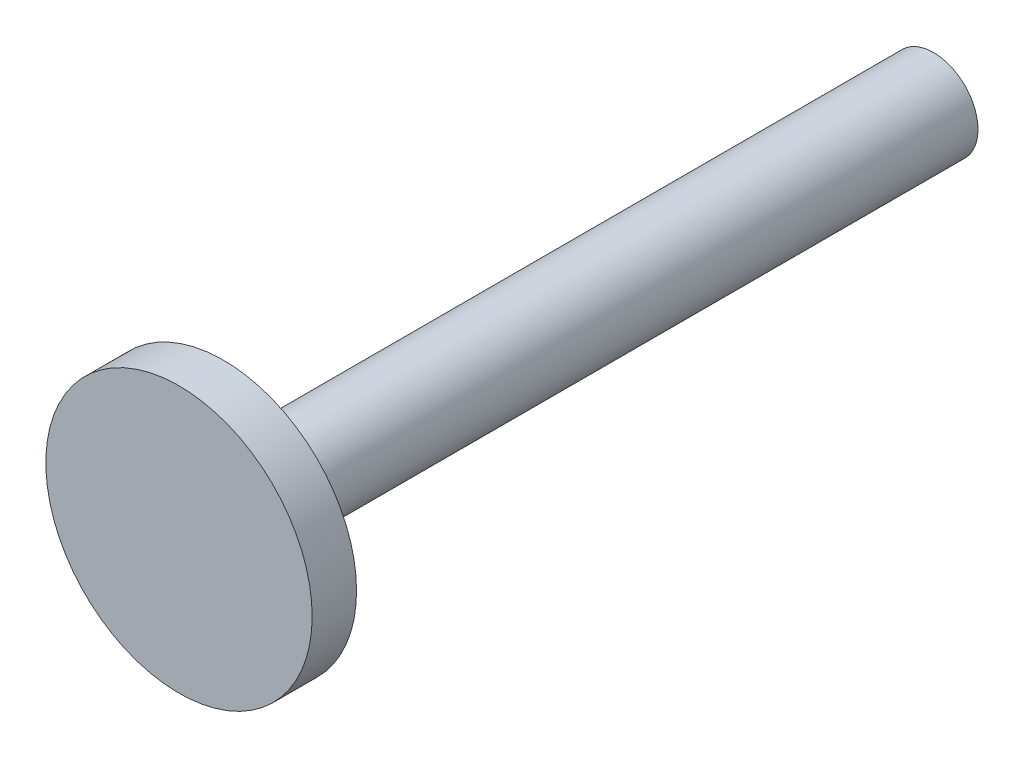
ISO-10303-21;
HEADER;
FILE_DESCRIPTION(('STEP AP214'),'2;1');
FILE_NAME('part.step','',(''),(''),'','','');
FILE_SCHEMA(('AUTOMOTIVE_DESIGN { 1 0 10303 214 1 1 1 1 }'));
ENDSEC;
DATA;
#1=APPLICATION_CONTEXT('core data for automotive mechanical design processes');
#2=APPLICATION_PROTOCOL_DEFINITION('international standard','automotive_design',2000,#1);
#3=PRODUCT_CONTEXT('',#1,'mechanical');
#4=PRODUCT('Part','Part','',(#3));
#5=PRODUCT_RELATED_PRODUCT_CATEGORY('part','',(#4));
#6=PRODUCT_DEFINITION_FORMATION('','',#4);
#7=PRODUCT_DEFINITION_CONTEXT('part definition',#1,'design');
#8=PRODUCT_DEFINITION('design','',#6,#7);
#9=PRODUCT_DEFINITION_SHAPE('','',#8);
#10=(LENGTH_UNIT() NAMED_UNIT(*) SI_UNIT(.MILLI.,.METRE.));
#11=(NAMED_UNIT(*) PLANE_ANGLE_UNIT() SI_UNIT($,.RADIAN.));
#12=(NAMED_UNIT(*) SI_UNIT($,.STERADIAN.) SOLID_ANGLE_UNIT());
#13=UNCERTAINTY_MEASURE_WITH_UNIT(LENGTH_MEASURE(1.E-05),#10,'distance_accuracy_value','');
#14=(GEOMETRIC_REPRESENTATION_CONTEXT(3) GLOBAL_UNCERTAINTY_ASSIGNED_CONTEXT((#13)) GLOBAL_UNIT_ASSIGNED_CONTEXT((#10,
#11,#12)) REPRESENTATION_CONTEXT('',''));
#15=CARTESIAN_POINT('',(0.,0.,0.));
#16=DIRECTION('',(0.,0.,1.));
#17=DIRECTION('',(1.,0.,0.));
#18=AXIS2_PLACEMENT_3D('',#15,#16,#17);
#19=CARTESIAN_POINT('',(0.,0.,10.));
#20=DIRECTION('',(0.,0.,-1.));
#21=DIRECTION('',(-1.,0.,0.));
#22=AXIS2_PLACEMENT_3D('',#19,#20,#21);
#23=CYLINDRICAL_SURFACE('',#22,10.);
#24=CARTESIAN_POINT('',(0.,0.,10.));
#25=DIRECTION('',(0.,0.,1.));
#26=DIRECTION('',(1.,0.,0.));
#27=AXIS2_PLACEMENT_3D('',#24,#25,#26);
#28=CIRCLE('',#27,10.);
#29=CARTESIAN_POINT('',(10.,0.,10.));
#30=VERTEX_POINT('',#29);
#31=EDGE_CURVE('E52',#30,#30,#28,.T.);
#32=ORIENTED_EDGE('',*,*,#31,.F.);
#33=EDGE_LOOP('',(#32));
#34=FACE_BOUND('',#33,.T.);
#35=CARTESIAN_POINT('',(0.,0.,-150.));
#36=DIRECTION('',(0.,0.,1.));
#37=DIRECTION('',(1.,0.,0.));
#38=AXIS2_PLACEMENT_3D('',#35,#36,#37);
#39=CIRCLE('',#38,10.);
#40=CARTESIAN_POINT('',(10.,0.,-150.));
#41=VERTEX_POINT('',#40);
#42=EDGE_CURVE('E61',#41,#41,#39,.T.);
#43=ORIENTED_EDGE('',*,*,#42,.T.);
#44=EDGE_LOOP('',(#43));
#45=FACE_BOUND('',#44,.T.);
#46=ADVANCED_FACE('F35',(#34,#45),#23,.T.);
#47=CARTESIAN_POINT('',(0.,0.,-150.));
#48=DIRECTION('',(0.,0.,1.));
#49=DIRECTION('',(1.,0.,0.));
#50=AXIS2_PLACEMENT_3D('',#47,#48,#49);
#51=PLANE('',#50);
#52=ORIENTED_EDGE('',*,*,#42,.F.);
#53=EDGE_LOOP('',(#52));
#54=FACE_BOUND('',#53,.T.);
#55=ADVANCED_FACE('F89',(#54),#51,.F.);
#56=CARTESIAN_POINT('',(0.,0.,20.));
#57=DIRECTION('',(0.,0.,-1.));
#58=DIRECTION('',(-1.,0.,0.));
#59=AXIS2_PLACEMENT_3D('',#56,#57,#58);
#60=CYLINDRICAL_SURFACE('',#59,30.);
#61=CARTESIAN_POINT('',(0.,0.,20.));
#62=DIRECTION('',(0.,0.,1.));
#63=DIRECTION('',(1.,0.,0.));
#64=AXIS2_PLACEMENT_3D('',#61,#62,#63);
#65=CIRCLE('',#64,30.);
#66=CARTESIAN_POINT('',(30.,0.,20.));
#67=VERTEX_POINT('',#66);
#68=EDGE_CURVE('E65',#67,#67,#65,.T.);
#69=ORIENTED_EDGE('',*,*,#68,.F.);
#70=EDGE_LOOP('',(#69));
#71=FACE_BOUND('',#70,.T.);
#72=CARTESIAN_POINT('',(0.,0.,10.));
#73=DIRECTION('',(0.,0.,1.));
#74=DIRECTION('',(1.,0.,0.));
#75=AXIS2_PLACEMENT_3D('',#72,#73,#74);
#76=CIRCLE('',#75,30.);
#77=CARTESIAN_POINT('',(30.,0.,10.));
#78=VERTEX_POINT('',#77);
#79=EDGE_CURVE('E69',#78,#78,#76,.T.);
#80=ORIENTED_EDGE('',*,*,#79,.T.);
#81=EDGE_LOOP('',(#80));
#82=FACE_BOUND('',#81,.T.);
#83=ADVANCED_FACE('F75',(#71,#82),#60,.T.);
#84=CARTESIAN_POINT('',(0.,0.,20.));
#85=DIRECTION('',(0.,0.,1.));
#86=DIRECTION('',(1.,0.,0.));
#87=AXIS2_PLACEMENT_3D('',#84,#85,#86);
#88=PLANE('',#87);
#89=ORIENTED_EDGE('',*,*,#68,.T.);
#90=EDGE_LOOP('',(#89));
#91=FACE_BOUND('',#90,.T.);
#92=ADVANCED_FACE('F79',(#91),#88,.T.);
#93=CARTESIAN_POINT('',(0.,0.,10.));
#94=DIRECTION('',(0.,0.,1.));
#95=DIRECTION('',(1.,0.,0.));
#96=AXIS2_PLACEMENT_3D('',#93,#94,#95);
#97=PLANE('',#96);
#98=ORIENTED_EDGE('',*,*,#31,.T.);
#99=EDGE_LOOP('',(#98));
#100=FACE_BOUND('',#99,.T.);
#101=ORIENTED_EDGE('',*,*,#79,.F.);
#102=EDGE_LOOP('',(#101));
#103=FACE_BOUND('',#102,.T.);
#104=ADVANCED_FACE('F77',(#100,#103),#97,.F.);
#105=CLOSED_SHELL('',(#46,#55,#83,#92,#104));
#106=CARTESIAN_POINT('',(0.,0.,10.));
#107=DIRECTION('',(0.,0.,-1.));
#108=DIRECTION('',(-1.,0.,0.));
#109=AXIS2_PLACEMENT_3D('',#106,#107,#108);
#110=CYLINDRICAL_SURFACE('',#109,9.);
#111=CARTESIAN_POINT('',(0.,0.,11.));
#112=DIRECTION('',(0.,0.,1.));
#113=DIRECTION('',(1.,0.,0.));
#114=AXIS2_PLACEMENT_3D('',#111,#112,#113);
#115=CIRCLE('',#114,9.);
#116=CARTESIAN_POINT('',(9.,0.,11.));
#117=VERTEX_POINT('',#116);
#118=EDGE_CURVE('E10',#117,#117,#115,.T.);
#119=ORIENTED_EDGE('',*,*,#118,.T.);
#120=EDGE_LOOP('',(#119));
#121=FACE_BOUND('',#120,.T.);
#122=CARTESIAN_POINT('',(0.,0.,-149.));
#123=DIRECTION('',(0.,0.,1.));
#124=DIRECTION('',(1.,0.,0.));
#125=AXIS2_PLACEMENT_3D('',#122,#123,#124);
#126=CIRCLE('',#125,9.);
#127=CARTESIAN_POINT('',(9.,0.,-149.));
#128=VERTEX_POINT('',#127);
#129=EDGE_CURVE('E39',#128,#128,#126,.T.);
#130=ORIENTED_EDGE('',*,*,#129,.F.);
#131=EDGE_LOOP('',(#130));
#132=FACE_BOUND('',#131,.T.);
#133=ADVANCED_FACE('F98',(#121,#132),#110,.F.);
#134=CARTESIAN_POINT('',(0.,0.,-149.));
#135=DIRECTION('',(0.,0.,1.));
#136=DIRECTION('',(1.,0.,0.));
#137=AXIS2_PLACEMENT_3D('',#134,#135,#136);
#138=PLANE('',#137);
#139=ORIENTED_EDGE('',*,*,#129,.T.);
#140=EDGE_LOOP('',(#139));
#141=FACE_BOUND('',#140,.T.);
#142=ADVANCED_FACE('F100',(#141),#138,.T.);
#143=CARTESIAN_POINT('',(0.,0.,20.));
#144=DIRECTION('',(0.,0.,-1.));
#145=DIRECTION('',(-1.,0.,0.));
#146=AXIS2_PLACEMENT_3D('',#143,#144,#145);
#147=CYLINDRICAL_SURFACE('',#146,29.);
#148=CARTESIAN_POINT('',(0.,0.,19.));
#149=DIRECTION('',(0.,0.,1.));
#150=DIRECTION('',(1.,0.,0.));
#151=AXIS2_PLACEMENT_3D('',#148,#149,#150);
#152=CIRCLE('',#151,29.);
#153=CARTESIAN_POINT('',(29.,0.,19.));
#154=VERTEX_POINT('',#153);
#155=EDGE_CURVE('E44',#154,#154,#152,.T.);
#156=ORIENTED_EDGE('',*,*,#155,.T.);
#157=EDGE_LOOP('',(#156));
#158=FACE_BOUND('',#157,.T.);
#159=CARTESIAN_POINT('',(0.,0.,11.));
#160=DIRECTION('',(0.,0.,1.));
#161=DIRECTION('',(1.,0.,0.));
#162=AXIS2_PLACEMENT_3D('',#159,#160,#161);
#163=CIRCLE('',#162,29.);
#164=CARTESIAN_POINT('',(29.,0.,11.));
#165=VERTEX_POINT('',#164);
#166=EDGE_CURVE('E49',#165,#165,#163,.T.);
#167=ORIENTED_EDGE('',*,*,#166,.F.);
#168=EDGE_LOOP('',(#167));
#169=FACE_BOUND('',#168,.T.);
#170=ADVANCED_FACE('F104',(#158,#169),#147,.F.);
#171=CARTESIAN_POINT('',(0.,0.,19.));
#172=DIRECTION('',(0.,0.,1.));
#173=DIRECTION('',(1.,0.,0.));
#174=AXIS2_PLACEMENT_3D('',#171,#172,#173);
#175=PLANE('',#174);
#176=ORIENTED_EDGE('',*,*,#155,.F.);
#177=EDGE_LOOP('',(#176));
#178=FACE_BOUND('',#177,.T.);
#179=ADVANCED_FACE('F106',(#178),#175,.F.);
#180=CARTESIAN_POINT('',(0.,0.,11.));
#181=DIRECTION('',(0.,0.,1.));
#182=DIRECTION('',(1.,0.,0.));
#183=AXIS2_PLACEMENT_3D('',#180,#181,#182);
#184=PLANE('',#183);
#185=ORIENTED_EDGE('',*,*,#118,.F.);
#186=EDGE_LOOP('',(#185));
#187=FACE_BOUND('',#186,.T.);
#188=ORIENTED_EDGE('',*,*,#166,.T.);
#189=EDGE_LOOP('',(#188));
#190=FACE_BOUND('',#189,.T.);
#191=ADVANCED_FACE('F37',(#187,#190),#184,.T.);
#192=CLOSED_SHELL('',(#133,#142,#170,#179,#191));
#193=ORIENTED_CLOSED_SHELL('',*,#192,.T.);
#194=BREP_WITH_VOIDS('B2',#105,(#193));
#195=ADVANCED_BREP_SHAPE_REPRESENTATION('',(#18,#194),#14);
#196=SHAPE_DEFINITION_REPRESENTATION(#9,#195);
ENDSEC;
END-ISO-10303-21;
